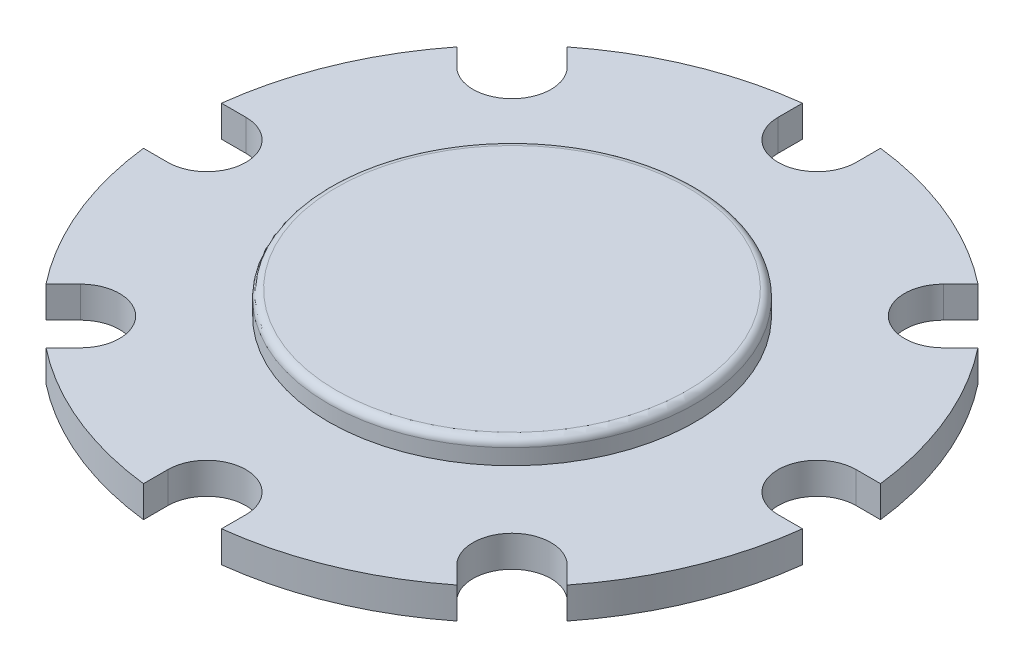
ISO-10303-21;
HEADER;
FILE_DESCRIPTION(('STEP AP214'),'2;1');
FILE_NAME('part.step','',(''),(''),'','','');
FILE_SCHEMA(('AUTOMOTIVE_DESIGN { 1 0 10303 214 1 1 1 1 }'));
ENDSEC;
DATA;
#1=APPLICATION_CONTEXT('core data for automotive mechanical design processes');
#2=APPLICATION_PROTOCOL_DEFINITION('international standard','automotive_design',2000,#1);
#3=PRODUCT_CONTEXT('',#1,'mechanical');
#4=PRODUCT('Part','Part','',(#3));
#5=PRODUCT_RELATED_PRODUCT_CATEGORY('part','',(#4));
#6=PRODUCT_DEFINITION_FORMATION('','',#4);
#7=PRODUCT_DEFINITION_CONTEXT('part definition',#1,'design');
#8=PRODUCT_DEFINITION('design','',#6,#7);
#9=PRODUCT_DEFINITION_SHAPE('','',#8);
#10=(LENGTH_UNIT() NAMED_UNIT(*) SI_UNIT(.MILLI.,.METRE.));
#11=(NAMED_UNIT(*) PLANE_ANGLE_UNIT() SI_UNIT($,.RADIAN.));
#12=(NAMED_UNIT(*) SI_UNIT($,.STERADIAN.) SOLID_ANGLE_UNIT());
#13=UNCERTAINTY_MEASURE_WITH_UNIT(LENGTH_MEASURE(1.E-05),#10,'distance_accuracy_value','');
#14=(GEOMETRIC_REPRESENTATION_CONTEXT(3) GLOBAL_UNCERTAINTY_ASSIGNED_CONTEXT((#13)) GLOBAL_UNIT_ASSIGNED_CONTEXT((#10,
#11,#12)) REPRESENTATION_CONTEXT('',''));
#15=CARTESIAN_POINT('',(0.,0.,0.));
#16=DIRECTION('',(0.,0.,1.));
#17=DIRECTION('',(1.,0.,0.));
#18=AXIS2_PLACEMENT_3D('',#15,#16,#17);
#19=CARTESIAN_POINT('',(0.,2.,0.));
#20=DIRECTION('',(0.,-1.,0.));
#21=DIRECTION('',(0.,0.,-1.));
#22=AXIS2_PLACEMENT_3D('',#19,#20,#21);
#23=CYLINDRICAL_SURFACE('',#22,21.25);
#24=CARTESIAN_POINT('',(0.,0.,0.));
#25=DIRECTION('',(0.,1.,0.));
#26=DIRECTION('',(0.,0.,1.));
#27=AXIS2_PLACEMENT_3D('',#24,#25,#26);
#28=CIRCLE('',#27,21.25);
#29=CARTESIAN_POINT('',(-16.689437435858,0.,-13.1539035299254));
#30=VERTEX_POINT('',#29);
#31=CARTESIAN_POINT('',(-21.1024287701677,0.,-2.50000000000007));
#32=VERTEX_POINT('',#31);
#33=EDGE_CURVE('E479',#30,#32,#28,.T.);
#34=ORIENTED_EDGE('',*,*,#33,.T.);
#35=DIRECTION('',(0.,-1.,0.));
#36=VECTOR('',#35,1.);
#37=CARTESIAN_POINT('',(-21.1024287701677,2.,-2.50000000000007));
#38=LINE('',#37,#36);
#39=CARTESIAN_POINT('',(-21.1024287701677,2.,-2.50000000000007));
#40=VERTEX_POINT('',#39);
#41=EDGE_CURVE('E254',#32,#40,#38,.F.);
#42=ORIENTED_EDGE('',*,*,#41,.T.);
#43=CARTESIAN_POINT('',(0.,2.,0.));
#44=DIRECTION('',(0.,1.,0.));
#45=DIRECTION('',(0.,0.,1.));
#46=AXIS2_PLACEMENT_3D('',#43,#44,#45);
#47=CIRCLE('',#46,21.25);
#48=CARTESIAN_POINT('',(-16.689437435858,2.,-13.1539035299254));
#49=VERTEX_POINT('',#48);
#50=EDGE_CURVE('E520',#49,#40,#47,.T.);
#51=ORIENTED_EDGE('',*,*,#50,.F.);
#52=DIRECTION('',(0.,-1.,0.));
#53=VECTOR('',#52,1.);
#54=CARTESIAN_POINT('',(-16.689437435858,2.,-13.1539035299254));
#55=LINE('',#54,#53);
#56=EDGE_CURVE('E358',#49,#30,#55,.T.);
#57=ORIENTED_EDGE('',*,*,#56,.T.);
#58=EDGE_LOOP('',(#34,#42,#51,#57));
#59=FACE_BOUND('',#58,.T.);
#60=ADVANCED_FACE('F33',(#59),#23,.T.);
#61=CARTESIAN_POINT('',(-2.5,0.,-21.1024287701677));
#62=VERTEX_POINT('',#61);
#63=CARTESIAN_POINT('',(-13.1539035299252,0.,-16.6894374358581));
#64=VERTEX_POINT('',#63);
#65=EDGE_CURVE('E470',#62,#64,#28,.T.);
#66=ORIENTED_EDGE('',*,*,#65,.T.);
#67=DIRECTION('',(0.,-1.,0.));
#68=VECTOR('',#67,1.);
#69=CARTESIAN_POINT('',(-13.1539035299252,2.,-16.6894374358581));
#70=LINE('',#69,#68);
#71=CARTESIAN_POINT('',(-13.1539035299252,2.,-16.6894374358581));
#72=VERTEX_POINT('',#71);
#73=EDGE_CURVE('E363',#64,#72,#70,.F.);
#74=ORIENTED_EDGE('',*,*,#73,.T.);
#75=CARTESIAN_POINT('',(-2.5,2.,-21.1024287701677));
#76=VERTEX_POINT('',#75);
#77=EDGE_CURVE('E517',#76,#72,#47,.T.);
#78=ORIENTED_EDGE('',*,*,#77,.F.);
#79=DIRECTION('',(0.,-1.,0.));
#80=VECTOR('',#79,1.);
#81=CARTESIAN_POINT('',(-2.5,2.,-21.1024287701677));
#82=LINE('',#81,#80);
#83=EDGE_CURVE('E346',#76,#62,#82,.T.);
#84=ORIENTED_EDGE('',*,*,#83,.T.);
#85=EDGE_LOOP('',(#66,#74,#78,#84));
#86=FACE_BOUND('',#85,.T.);
#87=ADVANCED_FACE('F475',(#86),#23,.T.);
#88=CARTESIAN_POINT('',(13.1539035299254,0.,-16.6894374358579));
#89=VERTEX_POINT('',#88);
#90=CARTESIAN_POINT('',(2.5,0.,-21.1024287701677));
#91=VERTEX_POINT('',#90);
#92=EDGE_CURVE('E478',#89,#91,#28,.T.);
#93=ORIENTED_EDGE('',*,*,#92,.T.);
#94=DIRECTION('',(0.,-1.,0.));
#95=VECTOR('',#94,1.);
#96=CARTESIAN_POINT('',(2.5,2.,-21.1024287701677));
#97=LINE('',#96,#95);
#98=CARTESIAN_POINT('',(2.5,2.,-21.1024287701677));
#99=VERTEX_POINT('',#98);
#100=EDGE_CURVE('E351',#91,#99,#97,.F.);
#101=ORIENTED_EDGE('',*,*,#100,.T.);
#102=CARTESIAN_POINT('',(13.1539035299254,2.,-16.6894374358579));
#103=VERTEX_POINT('',#102);
#104=EDGE_CURVE('E514',#103,#99,#47,.T.);
#105=ORIENTED_EDGE('',*,*,#104,.F.);
#106=DIRECTION('',(0.,-1.,0.));
#107=VECTOR('',#106,1.);
#108=CARTESIAN_POINT('',(13.1539035299254,2.,-16.6894374358579));
#109=LINE('',#108,#107);
#110=EDGE_CURVE('E334',#103,#89,#109,.T.);
#111=ORIENTED_EDGE('',*,*,#110,.T.);
#112=EDGE_LOOP('',(#93,#101,#105,#111));
#113=FACE_BOUND('',#112,.T.);
#114=ADVANCED_FACE('F552',(#113),#23,.T.);
#115=CARTESIAN_POINT('',(21.1024287701677,0.,-2.49999999999978));
#116=VERTEX_POINT('',#115);
#117=CARTESIAN_POINT('',(16.6894374358581,0.,-13.1539035299251));
#118=VERTEX_POINT('',#117);
#119=EDGE_CURVE('E481',#116,#118,#28,.T.);
#120=ORIENTED_EDGE('',*,*,#119,.T.);
#121=DIRECTION('',(0.,-1.,0.));
#122=VECTOR('',#121,1.);
#123=CARTESIAN_POINT('',(16.6894374358581,2.,-13.1539035299251));
#124=LINE('',#123,#122);
#125=CARTESIAN_POINT('',(16.6894374358581,2.,-13.1539035299251));
#126=VERTEX_POINT('',#125);
#127=EDGE_CURVE('E339',#118,#126,#124,.F.);
#128=ORIENTED_EDGE('',*,*,#127,.T.);
#129=CARTESIAN_POINT('',(21.1024287701677,2.,-2.49999999999978));
#130=VERTEX_POINT('',#129);
#131=EDGE_CURVE('E512',#130,#126,#47,.T.);
#132=ORIENTED_EDGE('',*,*,#131,.F.);
#133=DIRECTION('',(0.,-1.,0.));
#134=VECTOR('',#133,1.);
#135=CARTESIAN_POINT('',(21.1024287701677,2.,-2.49999999999978));
#136=LINE('',#135,#134);
#137=EDGE_CURVE('E322',#130,#116,#136,.T.);
#138=ORIENTED_EDGE('',*,*,#137,.T.);
#139=EDGE_LOOP('',(#120,#128,#132,#138));
#140=FACE_BOUND('',#139,.T.);
#141=ADVANCED_FACE('F494',(#140),#23,.T.);
#142=CARTESIAN_POINT('',(16.6894374358579,0.,13.1539035299255));
#143=VERTEX_POINT('',#142);
#144=CARTESIAN_POINT('',(21.1024287701676,0.,2.50000000000022));
#145=VERTEX_POINT('',#144);
#146=EDGE_CURVE('E441',#143,#145,#28,.T.);
#147=ORIENTED_EDGE('',*,*,#146,.T.);
#148=DIRECTION('',(0.,-1.,0.));
#149=VECTOR('',#148,1.);
#150=CARTESIAN_POINT('',(21.1024287701676,2.,2.50000000000022));
#151=LINE('',#150,#149);
#152=CARTESIAN_POINT('',(21.1024287701676,2.,2.50000000000022));
#153=VERTEX_POINT('',#152);
#154=EDGE_CURVE('E327',#145,#153,#151,.F.);
#155=ORIENTED_EDGE('',*,*,#154,.T.);
#156=CARTESIAN_POINT('',(16.6894374358579,2.,13.1539035299255));
#157=VERTEX_POINT('',#156);
#158=EDGE_CURVE('E435',#157,#153,#47,.T.);
#159=ORIENTED_EDGE('',*,*,#158,.F.);
#160=DIRECTION('',(0.,-1.,0.));
#161=VECTOR('',#160,1.);
#162=CARTESIAN_POINT('',(16.6894374358579,2.,13.1539035299255));
#163=LINE('',#162,#161);
#164=EDGE_CURVE('E310',#157,#143,#163,.T.);
#165=ORIENTED_EDGE('',*,*,#164,.T.);
#166=EDGE_LOOP('',(#147,#155,#159,#165));
#167=FACE_BOUND('',#166,.T.);
#168=ADVANCED_FACE('F560',(#167),#23,.T.);
#169=CARTESIAN_POINT('',(2.5,0.,21.1024287701677));
#170=VERTEX_POINT('',#169);
#171=CARTESIAN_POINT('',(13.1539035299251,0.,16.6894374358582));
#172=VERTEX_POINT('',#171);
#173=EDGE_CURVE('E438',#170,#172,#28,.T.);
#174=ORIENTED_EDGE('',*,*,#173,.T.);
#175=DIRECTION('',(0.,-1.,0.));
#176=VECTOR('',#175,1.);
#177=CARTESIAN_POINT('',(13.1539035299251,2.,16.6894374358582));
#178=LINE('',#177,#176);
#179=CARTESIAN_POINT('',(13.1539035299251,2.,16.6894374358582));
#180=VERTEX_POINT('',#179);
#181=EDGE_CURVE('E315',#172,#180,#178,.F.);
#182=ORIENTED_EDGE('',*,*,#181,.T.);
#183=CARTESIAN_POINT('',(2.5,2.,21.1024287701677));
#184=VERTEX_POINT('',#183);
#185=EDGE_CURVE('E431',#184,#180,#47,.T.);
#186=ORIENTED_EDGE('',*,*,#185,.F.);
#187=DIRECTION('',(0.,-1.,0.));
#188=VECTOR('',#187,1.);
#189=CARTESIAN_POINT('',(2.5,2.,21.1024287701677));
#190=LINE('',#189,#188);
#191=EDGE_CURVE('E416',#184,#170,#190,.T.);
#192=ORIENTED_EDGE('',*,*,#191,.T.);
#193=EDGE_LOOP('',(#174,#182,#186,#192));
#194=FACE_BOUND('',#193,.T.);
#195=ADVANCED_FACE('F546',(#194),#23,.T.);
#196=CARTESIAN_POINT('',(-21.1024287701677,2.,2.49999999999993));
#197=VERTEX_POINT('',#196);
#198=CARTESIAN_POINT('',(-16.689437435858,2.,13.1539035299253));
#199=VERTEX_POINT('',#198);
#200=EDGE_CURVE('E436',#197,#199,#47,.T.);
#201=ORIENTED_EDGE('',*,*,#200,.F.);
#202=DIRECTION('',(0.,-1.,0.));
#203=VECTOR('',#202,1.);
#204=CARTESIAN_POINT('',(-21.1024287701677,2.,2.49999999999993));
#205=LINE('',#204,#203);
#206=CARTESIAN_POINT('',(-21.1024287701677,0.,2.49999999999993));
#207=VERTEX_POINT('',#206);
#208=EDGE_CURVE('E370',#197,#207,#205,.T.);
#209=ORIENTED_EDGE('',*,*,#208,.T.);
#210=CARTESIAN_POINT('',(-16.689437435858,0.,13.1539035299253));
#211=VERTEX_POINT('',#210);
#212=EDGE_CURVE('E442',#207,#211,#28,.T.);
#213=ORIENTED_EDGE('',*,*,#212,.T.);
#214=DIRECTION('',(0.,-1.,0.));
#215=VECTOR('',#214,1.);
#216=CARTESIAN_POINT('',(-16.689437435858,2.,13.1539035299253));
#217=LINE('',#216,#215);
#218=EDGE_CURVE('E394',#211,#199,#217,.F.);
#219=ORIENTED_EDGE('',*,*,#218,.T.);
#220=EDGE_LOOP('',(#201,#209,#213,#219));
#221=FACE_BOUND('',#220,.T.);
#222=ADVANCED_FACE('F540',(#221),#23,.T.);
#223=CARTESIAN_POINT('',(-13.1539035299253,2.,16.689437435858));
#224=VERTEX_POINT('',#223);
#225=CARTESIAN_POINT('',(-2.5,2.,21.1024287701677));
#226=VERTEX_POINT('',#225);
#227=EDGE_CURVE('E437',#224,#226,#47,.T.);
#228=ORIENTED_EDGE('',*,*,#227,.F.);
#229=DIRECTION('',(0.,-1.,0.));
#230=VECTOR('',#229,1.);
#231=CARTESIAN_POINT('',(-13.1539035299253,2.,16.689437435858));
#232=LINE('',#231,#230);
#233=CARTESIAN_POINT('',(-13.1539035299253,0.,16.689437435858));
#234=VERTEX_POINT('',#233);
#235=EDGE_CURVE('E388',#224,#234,#232,.T.);
#236=ORIENTED_EDGE('',*,*,#235,.T.);
#237=CARTESIAN_POINT('',(-2.5,0.,21.1024287701677));
#238=VERTEX_POINT('',#237);
#239=EDGE_CURVE('E430',#234,#238,#28,.T.);
#240=ORIENTED_EDGE('',*,*,#239,.T.);
#241=DIRECTION('',(0.,-1.,0.));
#242=VECTOR('',#241,1.);
#243=CARTESIAN_POINT('',(-2.5,2.,21.1024287701677));
#244=LINE('',#243,#242);
#245=EDGE_CURVE('E422',#238,#226,#244,.F.);
#246=ORIENTED_EDGE('',*,*,#245,.T.);
#247=EDGE_LOOP('',(#228,#236,#240,#246));
#248=FACE_BOUND('',#247,.T.);
#249=ADVANCED_FACE('F538',(#248),#23,.T.);
#250=CARTESIAN_POINT('',(0.,2.,0.));
#251=DIRECTION('',(0.,1.,0.));
#252=DIRECTION('',(0.,0.,1.));
#253=AXIS2_PLACEMENT_3D('',#250,#251,#252);
#254=PLANE('',#253);
#255=DIRECTION('',(-1.,0.,0.));
#256=VECTOR('',#255,1.);
#257=CARTESIAN_POINT('',(0.,2.,-2.5));
#258=LINE('',#257,#256);
#259=CARTESIAN_POINT('',(-19.54,2.,-2.50000000000007));
#260=VERTEX_POINT('',#259);
#261=EDGE_CURVE('E373',#260,#40,#258,.T.);
#262=ORIENTED_EDGE('',*,*,#261,.F.);
#263=CARTESIAN_POINT('',(-19.54,2.,0.));
#264=DIRECTION('',(0.,1.,0.));
#265=DIRECTION('',(0.,0.,1.));
#266=AXIS2_PLACEMENT_3D('',#263,#264,#265);
#267=CIRCLE('',#266,2.5);
#268=CARTESIAN_POINT('',(-19.54,2.,2.49999999999993));
#269=VERTEX_POINT('',#268);
#270=EDGE_CURVE('E246',#269,#260,#267,.T.);
#271=ORIENTED_EDGE('',*,*,#270,.F.);
#272=DIRECTION('',(1.,0.,0.));
#273=VECTOR('',#272,1.);
#274=CARTESIAN_POINT('',(0.,2.,2.5));
#275=LINE('',#274,#273);
#276=EDGE_CURVE('E368',#197,#269,#275,.T.);
#277=ORIENTED_EDGE('',*,*,#276,.F.);
#278=ORIENTED_EDGE('',*,*,#200,.T.);
#279=DIRECTION('',(-0.707106781186549,0.,0.707106781186546));
#280=VECTOR('',#279,1.);
#281=CARTESIAN_POINT('',(-1.76776695296637,2.,-1.76776695296637));
#282=LINE('',#281,#280);
#283=CARTESIAN_POINT('',(-15.5846334573515,2.,12.0490995514187));
#284=VERTEX_POINT('',#283);
#285=EDGE_CURVE('E391',#284,#199,#282,.T.);
#286=ORIENTED_EDGE('',*,*,#285,.F.);
#287=CARTESIAN_POINT('',(-13.8168665043852,2.,13.8168665043851));
#288=DIRECTION('',(0.,1.,0.));
#289=DIRECTION('',(0.,0.,1.));
#290=AXIS2_PLACEMENT_3D('',#287,#288,#289);
#291=CIRCLE('',#290,2.5);
#292=CARTESIAN_POINT('',(-12.0490995514188,2.,15.5846334573515));
#293=VERTEX_POINT('',#292);
#294=EDGE_CURVE('E397',#293,#284,#291,.T.);
#295=ORIENTED_EDGE('',*,*,#294,.F.);
#296=DIRECTION('',(0.707106781186549,0.,-0.707106781186546));
#297=VECTOR('',#296,1.);
#298=CARTESIAN_POINT('',(1.76776695296637,2.,1.76776695296637));
#299=LINE('',#298,#297);
#300=EDGE_CURVE('E384',#224,#293,#299,.T.);
#301=ORIENTED_EDGE('',*,*,#300,.F.);
#302=ORIENTED_EDGE('',*,*,#227,.T.);
#303=DIRECTION('',(0.,0.,1.));
#304=VECTOR('',#303,1.);
#305=CARTESIAN_POINT('',(-2.5,2.,0.));
#306=LINE('',#305,#304);
#307=CARTESIAN_POINT('',(-2.5,2.,19.54));
#308=VERTEX_POINT('',#307);
#309=EDGE_CURVE('E419',#308,#226,#306,.T.);
#310=ORIENTED_EDGE('',*,*,#309,.F.);
#311=CARTESIAN_POINT('',(0.,2.,19.54));
#312=DIRECTION('',(0.,1.,0.));
#313=DIRECTION('',(0.,0.,1.));
#314=AXIS2_PLACEMENT_3D('',#311,#312,#313);
#315=CIRCLE('',#314,2.5);
#316=CARTESIAN_POINT('',(2.5,2.,19.54));
#317=VERTEX_POINT('',#316);
#318=EDGE_CURVE('E425',#317,#308,#315,.T.);
#319=ORIENTED_EDGE('',*,*,#318,.F.);
#320=DIRECTION('',(0.,0.,-1.));
#321=VECTOR('',#320,1.);
#322=CARTESIAN_POINT('',(2.5,2.,0.));
#323=LINE('',#322,#321);
#324=EDGE_CURVE('E412',#184,#317,#323,.T.);
#325=ORIENTED_EDGE('',*,*,#324,.F.);
#326=ORIENTED_EDGE('',*,*,#185,.T.);
#327=DIRECTION('',(0.707106781186539,0.,0.707106781186556));
#328=VECTOR('',#327,1.);
#329=CARTESIAN_POINT('',(-1.76776695296639,2.,1.76776695296635));
#330=LINE('',#329,#328);
#331=CARTESIAN_POINT('',(12.0490995514186,2.,15.5846334573517));
#332=VERTEX_POINT('',#331);
#333=EDGE_CURVE('E313',#332,#180,#330,.T.);
#334=ORIENTED_EDGE('',*,*,#333,.F.);
#335=CARTESIAN_POINT('',(13.816866504385,2.,13.8168665043853));
#336=DIRECTION('',(0.,1.,0.));
#337=DIRECTION('',(0.,0.,1.));
#338=AXIS2_PLACEMENT_3D('',#335,#336,#337);
#339=CIRCLE('',#338,2.5);
#340=CARTESIAN_POINT('',(15.5846334573514,2.,12.049099551419));
#341=VERTEX_POINT('',#340);
#342=EDGE_CURVE('E318',#341,#332,#339,.T.);
#343=ORIENTED_EDGE('',*,*,#342,.F.);
#344=DIRECTION('',(-0.707106781186539,0.,-0.707106781186556));
#345=VECTOR('',#344,1.);
#346=CARTESIAN_POINT('',(1.76776695296639,2.,-1.76776695296635));
#347=LINE('',#346,#345);
#348=EDGE_CURVE('E249',#157,#341,#347,.T.);
#349=ORIENTED_EDGE('',*,*,#348,.F.);
#350=ORIENTED_EDGE('',*,*,#158,.T.);
#351=DIRECTION('',(1.,0.,0.));
#352=VECTOR('',#351,1.);
#353=CARTESIAN_POINT('',(0.,2.,2.5));
#354=LINE('',#353,#352);
#355=CARTESIAN_POINT('',(19.54,2.,2.5000000000002));
#356=VERTEX_POINT('',#355);
#357=EDGE_CURVE('E325',#356,#153,#354,.T.);
#358=ORIENTED_EDGE('',*,*,#357,.F.);
#359=CARTESIAN_POINT('',(19.54,2.,2.04670636082985E-13));
#360=DIRECTION('',(0.,1.,0.));
#361=DIRECTION('',(0.,0.,1.));
#362=AXIS2_PLACEMENT_3D('',#359,#360,#361);
#363=CIRCLE('',#362,2.5);
#364=CARTESIAN_POINT('',(19.54,2.,-2.4999999999998));
#365=VERTEX_POINT('',#364);
#366=EDGE_CURVE('E330',#365,#356,#363,.T.);
#367=ORIENTED_EDGE('',*,*,#366,.F.);
#368=DIRECTION('',(-1.,0.,0.));
#369=VECTOR('',#368,1.);
#370=CARTESIAN_POINT('',(0.,2.,-2.5));
#371=LINE('',#370,#369);
#372=EDGE_CURVE('E320',#130,#365,#371,.T.);
#373=ORIENTED_EDGE('',*,*,#372,.F.);
#374=ORIENTED_EDGE('',*,*,#131,.T.);
#375=DIRECTION('',(0.707106781186554,0.,-0.707106781186541));
#376=VECTOR('',#375,1.);
#377=CARTESIAN_POINT('',(1.76776695296635,2.,1.76776695296638));
#378=LINE('',#377,#376);
#379=CARTESIAN_POINT('',(15.5846334573516,2.,-12.0490995514186));
#380=VERTEX_POINT('',#379);
#381=EDGE_CURVE('E337',#380,#126,#378,.T.);
#382=ORIENTED_EDGE('',*,*,#381,.F.);
#383=CARTESIAN_POINT('',(13.8168665043853,2.,-13.816866504385));
#384=DIRECTION('',(0.,1.,0.));
#385=DIRECTION('',(0.,0.,1.));
#386=AXIS2_PLACEMENT_3D('',#383,#384,#385);
#387=CIRCLE('',#386,2.5);
#388=CARTESIAN_POINT('',(12.0490995514189,2.,-15.5846334573514));
#389=VERTEX_POINT('',#388);
#390=EDGE_CURVE('E342',#389,#380,#387,.T.);
#391=ORIENTED_EDGE('',*,*,#390,.F.);
#392=DIRECTION('',(-0.707106781186554,0.,0.707106781186541));
#393=VECTOR('',#392,1.);
#394=CARTESIAN_POINT('',(-1.76776695296635,2.,-1.76776695296638));
#395=LINE('',#394,#393);
#396=EDGE_CURVE('E332',#103,#389,#395,.T.);
#397=ORIENTED_EDGE('',*,*,#396,.F.);
#398=ORIENTED_EDGE('',*,*,#104,.T.);
#399=DIRECTION('',(0.,0.,-1.));
#400=VECTOR('',#399,1.);
#401=CARTESIAN_POINT('',(2.5,2.,0.));
#402=LINE('',#401,#400);
#403=CARTESIAN_POINT('',(2.5,2.,-19.54));
#404=VERTEX_POINT('',#403);
#405=EDGE_CURVE('E349',#404,#99,#402,.T.);
#406=ORIENTED_EDGE('',*,*,#405,.F.);
#407=CARTESIAN_POINT('',(0.,2.,-19.54));
#408=DIRECTION('',(0.,1.,0.));
#409=DIRECTION('',(0.,0.,1.));
#410=AXIS2_PLACEMENT_3D('',#407,#408,#409);
#411=CIRCLE('',#410,2.5);
#412=CARTESIAN_POINT('',(-2.5,2.,-19.54));
#413=VERTEX_POINT('',#412);
#414=EDGE_CURVE('E354',#413,#404,#411,.T.);
#415=ORIENTED_EDGE('',*,*,#414,.F.);
#416=DIRECTION('',(0.,0.,1.));
#417=VECTOR('',#416,1.);
#418=CARTESIAN_POINT('',(-2.5,2.,0.));
#419=LINE('',#418,#417);
#420=EDGE_CURVE('E344',#76,#413,#419,.T.);
#421=ORIENTED_EDGE('',*,*,#420,.F.);
#422=ORIENTED_EDGE('',*,*,#77,.T.);
#423=DIRECTION('',(-0.707106781186544,0.,-0.707106781186551));
#424=VECTOR('',#423,1.);
#425=CARTESIAN_POINT('',(1.76776695296638,2.,-1.76776695296636));
#426=LINE('',#425,#424);
#427=CARTESIAN_POINT('',(-12.0490995514187,2.,-15.5846334573516));
#428=VERTEX_POINT('',#427);
#429=EDGE_CURVE('E361',#428,#72,#426,.T.);
#430=ORIENTED_EDGE('',*,*,#429,.F.);
#431=CARTESIAN_POINT('',(-13.8168665043851,2.,-13.8168665043852));
#432=DIRECTION('',(0.,1.,0.));
#433=DIRECTION('',(0.,0.,1.));
#434=AXIS2_PLACEMENT_3D('',#431,#432,#433);
#435=CIRCLE('',#434,2.5);
#436=CARTESIAN_POINT('',(-15.5846334573515,2.,-12.0490995514189));
#437=VERTEX_POINT('',#436);
#438=EDGE_CURVE('E366',#437,#428,#435,.T.);
#439=ORIENTED_EDGE('',*,*,#438,.F.);
#440=DIRECTION('',(0.707106781186544,0.,0.707106781186551));
#441=VECTOR('',#440,1.);
#442=CARTESIAN_POINT('',(-1.76776695296638,2.,1.76776695296636));
#443=LINE('',#442,#441);
#444=EDGE_CURVE('E356',#49,#437,#443,.T.);
#445=ORIENTED_EDGE('',*,*,#444,.F.);
#446=ORIENTED_EDGE('',*,*,#50,.T.);
#447=EDGE_LOOP('',(#262,#271,#277,#278,#286,#295,#301,#302,#310,#319,#325,#326,#334,#343,#349,
#350,#358,#367,#373,#374,#382,#391,#397,#398,#406,#415,#421,#422,#430,#439,#445,#446));
#448=FACE_BOUND('',#447,.T.);
#449=CARTESIAN_POINT('',(0.,2.,0.));
#450=DIRECTION('',(0.,1.,0.));
#451=DIRECTION('',(0.,0.,1.));
#452=AXIS2_PLACEMENT_3D('',#449,#450,#451);
#453=CIRCLE('',#452,11.75);
#454=CARTESIAN_POINT('',(0.,2.,11.75));
#455=VERTEX_POINT('',#454);
#456=EDGE_CURVE('E427',#455,#455,#453,.T.);
#457=ORIENTED_EDGE('',*,*,#456,.F.);
#458=EDGE_LOOP('',(#457));
#459=FACE_BOUND('',#458,.T.);
#460=ADVANCED_FACE('F508',(#448,#459),#254,.T.);
#461=CARTESIAN_POINT('',(0.,0.,0.));
#462=DIRECTION('',(0.,1.,0.));
#463=DIRECTION('',(0.,0.,1.));
#464=AXIS2_PLACEMENT_3D('',#461,#462,#463);
#465=PLANE('',#464);
#466=CARTESIAN_POINT('',(0.,0.,0.));
#467=DIRECTION('',(0.,-1.,0.));
#468=DIRECTION('',(0.,0.,-1.));
#469=AXIS2_PLACEMENT_3D('',#466,#467,#468);
#470=CIRCLE('',#469,1.65438293583384);
#471=CARTESIAN_POINT('',(0.,0.,-1.65438293583384));
#472=VERTEX_POINT('',#471);
#473=EDGE_CURVE('E399',#472,#472,#470,.T.);
#474=ORIENTED_EDGE('',*,*,#473,.F.);
#475=EDGE_LOOP('',(#474));
#476=FACE_BOUND('',#475,.T.);
#477=CARTESIAN_POINT('',(-19.54,0.,0.));
#478=DIRECTION('',(0.,-1.,0.));
#479=DIRECTION('',(1.,0.,0.));
#480=AXIS2_PLACEMENT_3D('',#477,#478,#479);
#481=CIRCLE('',#480,2.5);
#482=CARTESIAN_POINT('',(-19.54,0.,-2.50000000000007));
#483=VERTEX_POINT('',#482);
#484=CARTESIAN_POINT('',(-19.54,0.,2.49999999999993));
#485=VERTEX_POINT('',#484);
#486=EDGE_CURVE('E48',#483,#485,#481,.T.);
#487=ORIENTED_EDGE('',*,*,#486,.F.);
#488=DIRECTION('',(-1.,0.,0.));
#489=VECTOR('',#488,1.);
#490=CARTESIAN_POINT('',(0.,0.,-2.5));
#491=LINE('',#490,#489);
#492=EDGE_CURVE('E11',#483,#32,#491,.T.);
#493=ORIENTED_EDGE('',*,*,#492,.T.);
#494=ORIENTED_EDGE('',*,*,#33,.F.);
#495=DIRECTION('',(-0.707106781186544,0.,-0.707106781186551));
#496=VECTOR('',#495,1.);
#497=CARTESIAN_POINT('',(-15.5846334573515,0.,-12.0490995514189));
#498=LINE('',#497,#496);
#499=CARTESIAN_POINT('',(-15.5846334573515,0.,-12.0490995514189));
#500=VERTEX_POINT('',#499);
#501=EDGE_CURVE('E270',#500,#30,#498,.T.);
#502=ORIENTED_EDGE('',*,*,#501,.F.);
#503=CARTESIAN_POINT('',(-13.8168665043851,0.,-13.8168665043852));
#504=DIRECTION('',(0.,-1.,0.));
#505=DIRECTION('',(0.707106781186544,0.,0.707106781186551));
#506=AXIS2_PLACEMENT_3D('',#503,#504,#505);
#507=CIRCLE('',#506,2.5);
#508=CARTESIAN_POINT('',(-12.0490995514187,0.,-15.5846334573516));
#509=VERTEX_POINT('',#508);
#510=EDGE_CURVE('E56',#509,#500,#507,.T.);
#511=ORIENTED_EDGE('',*,*,#510,.F.);
#512=DIRECTION('',(-0.707106781186544,0.,-0.707106781186551));
#513=VECTOR('',#512,1.);
#514=CARTESIAN_POINT('',(1.76776695296638,0.,-1.76776695296636));
#515=LINE('',#514,#513);
#516=EDGE_CURVE('E41',#509,#64,#515,.T.);
#517=ORIENTED_EDGE('',*,*,#516,.T.);
#518=ORIENTED_EDGE('',*,*,#65,.F.);
#519=DIRECTION('',(0.,0.,-1.));
#520=VECTOR('',#519,1.);
#521=CARTESIAN_POINT('',(-2.5,0.,-19.54));
#522=LINE('',#521,#520);
#523=CARTESIAN_POINT('',(-2.5,0.,-19.54));
#524=VERTEX_POINT('',#523);
#525=EDGE_CURVE('E276',#524,#62,#522,.T.);
#526=ORIENTED_EDGE('',*,*,#525,.F.);
#527=CARTESIAN_POINT('',(0.,0.,-19.54));
#528=DIRECTION('',(0.,-1.,0.));
#529=DIRECTION('',(0.,0.,1.));
#530=AXIS2_PLACEMENT_3D('',#527,#528,#529);
#531=CIRCLE('',#530,2.5);
#532=CARTESIAN_POINT('',(2.5,0.,-19.54));
#533=VERTEX_POINT('',#532);
#534=EDGE_CURVE('E274',#533,#524,#531,.T.);
#535=ORIENTED_EDGE('',*,*,#534,.F.);
#536=DIRECTION('',(0.,0.,-1.));
#537=VECTOR('',#536,1.);
#538=CARTESIAN_POINT('',(2.5,0.,0.));
#539=LINE('',#538,#537);
#540=EDGE_CURVE('E463',#533,#91,#539,.T.);
#541=ORIENTED_EDGE('',*,*,#540,.T.);
#542=ORIENTED_EDGE('',*,*,#92,.F.);
#543=DIRECTION('',(0.707106781186554,0.,-0.707106781186541));
#544=VECTOR('',#543,1.);
#545=CARTESIAN_POINT('',(12.0490995514189,0.,-15.5846334573514));
#546=LINE('',#545,#544);
#547=CARTESIAN_POINT('',(12.0490995514189,0.,-15.5846334573514));
#548=VERTEX_POINT('',#547);
#549=EDGE_CURVE('E285',#548,#89,#546,.T.);
#550=ORIENTED_EDGE('',*,*,#549,.F.);
#551=CARTESIAN_POINT('',(13.8168665043853,0.,-13.816866504385));
#552=DIRECTION('',(0.,-1.,0.));
#553=DIRECTION('',(-0.707106781186554,0.,0.707106781186541));
#554=AXIS2_PLACEMENT_3D('',#551,#552,#553);
#555=CIRCLE('',#554,2.5);
#556=CARTESIAN_POINT('',(15.5846334573516,0.,-12.0490995514186));
#557=VERTEX_POINT('',#556);
#558=EDGE_CURVE('E283',#557,#548,#555,.T.);
#559=ORIENTED_EDGE('',*,*,#558,.F.);
#560=DIRECTION('',(0.707106781186554,0.,-0.707106781186541));
#561=VECTOR('',#560,1.);
#562=CARTESIAN_POINT('',(1.76776695296635,0.,1.76776695296638));
#563=LINE('',#562,#561);
#564=EDGE_CURVE('E460',#557,#118,#563,.T.);
#565=ORIENTED_EDGE('',*,*,#564,.T.);
#566=ORIENTED_EDGE('',*,*,#119,.F.);
#567=DIRECTION('',(1.,0.,0.));
#568=VECTOR('',#567,1.);
#569=CARTESIAN_POINT('',(19.54,0.,-2.4999999999998));
#570=LINE('',#569,#568);
#571=CARTESIAN_POINT('',(19.54,0.,-2.4999999999998));
#572=VERTEX_POINT('',#571);
#573=EDGE_CURVE('E294',#572,#116,#570,.T.);
#574=ORIENTED_EDGE('',*,*,#573,.F.);
#575=CARTESIAN_POINT('',(19.54,0.,2.04670636082985E-13));
#576=DIRECTION('',(0.,-1.,0.));
#577=DIRECTION('',(-1.,0.,0.));
#578=AXIS2_PLACEMENT_3D('',#575,#576,#577);
#579=CIRCLE('',#578,2.5);
#580=CARTESIAN_POINT('',(19.54,0.,2.5000000000002));
#581=VERTEX_POINT('',#580);
#582=EDGE_CURVE('E292',#581,#572,#579,.T.);
#583=ORIENTED_EDGE('',*,*,#582,.F.);
#584=DIRECTION('',(1.,0.,0.));
#585=VECTOR('',#584,1.);
#586=CARTESIAN_POINT('',(0.,0.,2.5));
#587=LINE('',#586,#585);
#588=EDGE_CURVE('E457',#581,#145,#587,.T.);
#589=ORIENTED_EDGE('',*,*,#588,.T.);
#590=ORIENTED_EDGE('',*,*,#146,.F.);
#591=DIRECTION('',(0.707106781186539,0.,0.707106781186556));
#592=VECTOR('',#591,1.);
#593=CARTESIAN_POINT('',(15.5846334573514,0.,12.049099551419));
#594=LINE('',#593,#592);
#595=CARTESIAN_POINT('',(15.5846334573514,0.,12.049099551419));
#596=VERTEX_POINT('',#595);
#597=EDGE_CURVE('E303',#596,#143,#594,.T.);
#598=ORIENTED_EDGE('',*,*,#597,.F.);
#599=CARTESIAN_POINT('',(13.816866504385,0.,13.8168665043853));
#600=DIRECTION('',(0.,-1.,0.));
#601=DIRECTION('',(-0.707106781186539,0.,-0.707106781186556));
#602=AXIS2_PLACEMENT_3D('',#599,#600,#601);
#603=CIRCLE('',#602,2.5);
#604=CARTESIAN_POINT('',(12.0490995514186,0.,15.5846334573517));
#605=VERTEX_POINT('',#604);
#606=EDGE_CURVE('E301',#605,#596,#603,.T.);
#607=ORIENTED_EDGE('',*,*,#606,.F.);
#608=DIRECTION('',(0.707106781186539,0.,0.707106781186556));
#609=VECTOR('',#608,1.);
#610=CARTESIAN_POINT('',(-1.76776695296639,0.,1.76776695296635));
#611=LINE('',#610,#609);
#612=EDGE_CURVE('E454',#605,#172,#611,.T.);
#613=ORIENTED_EDGE('',*,*,#612,.T.);
#614=ORIENTED_EDGE('',*,*,#173,.F.);
#615=DIRECTION('',(0.,0.,1.));
#616=VECTOR('',#615,1.);
#617=CARTESIAN_POINT('',(2.5,0.,19.54));
#618=LINE('',#617,#616);
#619=CARTESIAN_POINT('',(2.5,0.,19.54));
#620=VERTEX_POINT('',#619);
#621=EDGE_CURVE('E407',#620,#170,#618,.T.);
#622=ORIENTED_EDGE('',*,*,#621,.F.);
#623=CARTESIAN_POINT('',(0.,0.,19.54));
#624=DIRECTION('',(0.,-1.,0.));
#625=DIRECTION('',(0.,0.,-1.));
#626=AXIS2_PLACEMENT_3D('',#623,#624,#625);
#627=CIRCLE('',#626,2.5);
#628=CARTESIAN_POINT('',(-2.5,0.,19.54));
#629=VERTEX_POINT('',#628);
#630=EDGE_CURVE('E403',#629,#620,#627,.T.);
#631=ORIENTED_EDGE('',*,*,#630,.F.);
#632=DIRECTION('',(0.,0.,1.));
#633=VECTOR('',#632,1.);
#634=CARTESIAN_POINT('',(-2.5,0.,0.));
#635=LINE('',#634,#633);
#636=EDGE_CURVE('E448',#629,#238,#635,.T.);
#637=ORIENTED_EDGE('',*,*,#636,.T.);
#638=ORIENTED_EDGE('',*,*,#239,.F.);
#639=DIRECTION('',(-0.707106781186549,0.,0.707106781186546));
#640=VECTOR('',#639,1.);
#641=CARTESIAN_POINT('',(-12.0490995514188,0.,15.5846334573515));
#642=LINE('',#641,#640);
#643=CARTESIAN_POINT('',(-12.0490995514188,0.,15.5846334573515));
#644=VERTEX_POINT('',#643);
#645=EDGE_CURVE('E379',#644,#234,#642,.T.);
#646=ORIENTED_EDGE('',*,*,#645,.F.);
#647=CARTESIAN_POINT('',(-13.8168665043852,0.,13.8168665043851));
#648=DIRECTION('',(0.,-1.,0.));
#649=DIRECTION('',(0.707106781186549,0.,-0.707106781186546));
#650=AXIS2_PLACEMENT_3D('',#647,#648,#649);
#651=CIRCLE('',#650,2.5);
#652=CARTESIAN_POINT('',(-15.5846334573515,0.,12.0490995514187));
#653=VERTEX_POINT('',#652);
#654=EDGE_CURVE('E377',#653,#644,#651,.T.);
#655=ORIENTED_EDGE('',*,*,#654,.F.);
#656=DIRECTION('',(-0.707106781186549,0.,0.707106781186546));
#657=VECTOR('',#656,1.);
#658=CARTESIAN_POINT('',(-1.76776695296637,0.,-1.76776695296637));
#659=LINE('',#658,#657);
#660=EDGE_CURVE('E451',#653,#211,#659,.T.);
#661=ORIENTED_EDGE('',*,*,#660,.T.);
#662=ORIENTED_EDGE('',*,*,#212,.F.);
#663=DIRECTION('',(-1.,0.,0.));
#664=VECTOR('',#663,1.);
#665=CARTESIAN_POINT('',(-19.54,0.,2.49999999999993));
#666=LINE('',#665,#664);
#667=EDGE_CURVE('E261',#485,#207,#666,.T.);
#668=ORIENTED_EDGE('',*,*,#667,.F.);
#669=EDGE_LOOP('',(#487,#493,#494,#502,#511,#517,#518,#526,#535,#541,#542,#550,#559,#565,#566,
#574,#583,#589,#590,#598,#607,#613,#614,#622,#631,#637,#638,#646,#655,#661,#662,#668));
#670=FACE_BOUND('',#669,.T.);
#671=ADVANCED_FACE('F259',(#476,#670),#465,.F.);
#672=CARTESIAN_POINT('',(0.,3.5,0.));
#673=DIRECTION('',(0.,-1.,0.));
#674=DIRECTION('',(0.,0.,-1.));
#675=AXIS2_PLACEMENT_3D('',#672,#673,#674);
#676=CYLINDRICAL_SURFACE('',#675,11.75);
#677=CARTESIAN_POINT('',(0.,3.,0.));
#678=DIRECTION('',(0.,1.,0.));
#679=DIRECTION('',(0.,0.,1.));
#680=AXIS2_PLACEMENT_3D('',#677,#678,#679);
#681=CIRCLE('',#680,11.75);
#682=CARTESIAN_POINT('',(0.,3.,11.75));
#683=VERTEX_POINT('',#682);
#684=EDGE_CURVE('E445',#683,#683,#681,.F.);
#685=ORIENTED_EDGE('',*,*,#684,.T.);
#686=EDGE_LOOP('',(#685));
#687=FACE_BOUND('',#686,.T.);
#688=ORIENTED_EDGE('',*,*,#456,.T.);
#689=EDGE_LOOP('',(#688));
#690=FACE_BOUND('',#689,.T.);
#691=ADVANCED_FACE('F651',(#687,#690),#676,.T.);
#692=CARTESIAN_POINT('',(0.,3.5,0.));
#693=DIRECTION('',(0.,1.,0.));
#694=DIRECTION('',(0.,0.,1.));
#695=AXIS2_PLACEMENT_3D('',#692,#693,#694);
#696=PLANE('',#695);
#697=CARTESIAN_POINT('',(0.,3.5,0.));
#698=DIRECTION('',(0.,1.,0.));
#699=DIRECTION('',(0.,0.,1.));
#700=AXIS2_PLACEMENT_3D('',#697,#698,#699);
#701=CIRCLE('',#700,11.25);
#702=CARTESIAN_POINT('',(0.,3.5,11.25));
#703=VERTEX_POINT('',#702);
#704=EDGE_CURVE('E434',#703,#703,#701,.T.);
#705=ORIENTED_EDGE('',*,*,#704,.T.);
#706=EDGE_LOOP('',(#705));
#707=FACE_BOUND('',#706,.T.);
#708=ADVANCED_FACE('F648',(#707),#696,.T.);
#709=CARTESIAN_POINT('',(0.,3.,0.));
#710=DIRECTION('',(0.,1.,0.));
#711=DIRECTION('',(0.,0.,1.));
#712=AXIS2_PLACEMENT_3D('',#709,#710,#711);
#713=TOROIDAL_SURFACE('',#712,11.25,0.5);
#714=ORIENTED_EDGE('',*,*,#684,.F.);
#715=EDGE_LOOP('',(#714));
#716=FACE_BOUND('',#715,.T.);
#717=ORIENTED_EDGE('',*,*,#704,.F.);
#718=EDGE_LOOP('',(#717));
#719=FACE_BOUND('',#718,.T.);
#720=ADVANCED_FACE('F35',(#716,#719),#713,.T.);
#721=CARTESIAN_POINT('',(-2.5,3.5,19.54));
#722=DIRECTION('',(-1.,0.,0.));
#723=DIRECTION('',(0.,0.,1.));
#724=AXIS2_PLACEMENT_3D('',#721,#722,#723);
#725=PLANE('',#724);
#726=ORIENTED_EDGE('',*,*,#636,.F.);
#727=DIRECTION('',(0.,-1.,0.));
#728=VECTOR('',#727,1.);
#729=CARTESIAN_POINT('',(-2.5,3.5,19.54));
#730=LINE('',#729,#728);
#731=EDGE_CURVE('E410',#308,#629,#730,.T.);
#732=ORIENTED_EDGE('',*,*,#731,.F.);
#733=ORIENTED_EDGE('',*,*,#309,.T.);
#734=ORIENTED_EDGE('',*,*,#245,.F.);
#735=EDGE_LOOP('',(#726,#732,#733,#734));
#736=FACE_BOUND('',#735,.T.);
#737=ADVANCED_FACE('F537',(#736),#725,.F.);
#738=CARTESIAN_POINT('',(2.5,3.5,19.54));
#739=DIRECTION('',(1.,0.,0.));
#740=DIRECTION('',(0.,0.,-1.));
#741=AXIS2_PLACEMENT_3D('',#738,#739,#740);
#742=PLANE('',#741);
#743=ORIENTED_EDGE('',*,*,#324,.T.);
#744=DIRECTION('',(0.,-1.,0.));
#745=VECTOR('',#744,1.);
#746=CARTESIAN_POINT('',(2.5,3.5,19.54));
#747=LINE('',#746,#745);
#748=EDGE_CURVE('E409',#317,#620,#747,.T.);
#749=ORIENTED_EDGE('',*,*,#748,.T.);
#750=ORIENTED_EDGE('',*,*,#621,.T.);
#751=ORIENTED_EDGE('',*,*,#191,.F.);
#752=EDGE_LOOP('',(#743,#749,#750,#751));
#753=FACE_BOUND('',#752,.T.);
#754=ADVANCED_FACE('F641',(#753),#742,.F.);
#755=CARTESIAN_POINT('',(0.,3.5,19.54));
#756=DIRECTION('',(0.,-1.,0.));
#757=DIRECTION('',(0.,0.,-1.));
#758=AXIS2_PLACEMENT_3D('',#755,#756,#757);
#759=CYLINDRICAL_SURFACE('',#758,2.5);
#760=ORIENTED_EDGE('',*,*,#318,.T.);
#761=ORIENTED_EDGE('',*,*,#731,.T.);
#762=ORIENTED_EDGE('',*,*,#630,.T.);
#763=ORIENTED_EDGE('',*,*,#748,.F.);
#764=EDGE_LOOP('',(#760,#761,#762,#763));
#765=FACE_BOUND('',#764,.T.);
#766=ADVANCED_FACE('F637',(#765),#759,.F.);
#767=CARTESIAN_POINT('',(0.,0.01,0.));
#768=DIRECTION('',(0.,-1.,0.));
#769=DIRECTION('',(0.,0.,-1.));
#770=AXIS2_PLACEMENT_3D('',#767,#768,#769);
#771=CYLINDRICAL_SURFACE('',#770,1.65438293583384);
#772=CARTESIAN_POINT('',(0.,0.01,0.));
#773=DIRECTION('',(0.,-1.,0.));
#774=DIRECTION('',(0.,0.,-1.));
#775=AXIS2_PLACEMENT_3D('',#772,#773,#774);
#776=CIRCLE('',#775,1.65438293583384);
#777=CARTESIAN_POINT('',(0.,0.01,-1.65438293583384));
#778=VERTEX_POINT('',#777);
#779=EDGE_CURVE('E400',#778,#778,#776,.T.);
#780=ORIENTED_EDGE('',*,*,#779,.F.);
#781=EDGE_LOOP('',(#780));
#782=FACE_BOUND('',#781,.T.);
#783=ORIENTED_EDGE('',*,*,#473,.T.);
#784=EDGE_LOOP('',(#783));
#785=FACE_BOUND('',#784,.T.);
#786=ADVANCED_FACE('F633',(#782,#785),#771,.F.);
#787=CARTESIAN_POINT('',(0.,0.01,0.));
#788=DIRECTION('',(0.,-1.,0.));
#789=DIRECTION('',(0.,0.,-1.));
#790=AXIS2_PLACEMENT_3D('',#787,#788,#789);
#791=PLANE('',#790);
#792=ORIENTED_EDGE('',*,*,#779,.T.);
#793=EDGE_LOOP('',(#792));
#794=FACE_BOUND('',#793,.T.);
#795=ADVANCED_FACE('F623',(#794),#791,.T.);
#796=CARTESIAN_POINT('',(-15.5846334573515,3.5,12.0490995514187));
#797=DIRECTION('',(-0.707106781186546,0.,-0.707106781186549));
#798=DIRECTION('',(-0.707106781186549,0.,0.707106781186546));
#799=AXIS2_PLACEMENT_3D('',#796,#797,#798);
#800=PLANE('',#799);
#801=ORIENTED_EDGE('',*,*,#660,.F.);
#802=DIRECTION('',(0.,-1.,0.));
#803=VECTOR('',#802,1.);
#804=CARTESIAN_POINT('',(-15.5846334573515,3.5,12.0490995514187));
#805=LINE('',#804,#803);
#806=EDGE_CURVE('E382',#284,#653,#805,.T.);
#807=ORIENTED_EDGE('',*,*,#806,.F.);
#808=ORIENTED_EDGE('',*,*,#285,.T.);
#809=ORIENTED_EDGE('',*,*,#218,.F.);
#810=EDGE_LOOP('',(#801,#807,#808,#809));
#811=FACE_BOUND('',#810,.T.);
#812=ADVANCED_FACE('F619',(#811),#800,.F.);
#813=CARTESIAN_POINT('',(-12.0490995514188,3.5,15.5846334573515));
#814=DIRECTION('',(0.707106781186546,0.,0.707106781186549));
#815=DIRECTION('',(0.707106781186549,0.,-0.707106781186546));
#816=AXIS2_PLACEMENT_3D('',#813,#814,#815);
#817=PLANE('',#816);
#818=ORIENTED_EDGE('',*,*,#300,.T.);
#819=DIRECTION('',(0.,-1.,0.));
#820=VECTOR('',#819,1.);
#821=CARTESIAN_POINT('',(-12.0490995514188,3.5,15.5846334573515));
#822=LINE('',#821,#820);
#823=EDGE_CURVE('E381',#293,#644,#822,.T.);
#824=ORIENTED_EDGE('',*,*,#823,.T.);
#825=ORIENTED_EDGE('',*,*,#645,.T.);
#826=ORIENTED_EDGE('',*,*,#235,.F.);
#827=EDGE_LOOP('',(#818,#824,#825,#826));
#828=FACE_BOUND('',#827,.T.);
#829=ADVANCED_FACE('F622',(#828),#817,.F.);
#830=CARTESIAN_POINT('',(-13.8168665043852,3.5,13.8168665043851));
#831=DIRECTION('',(0.,-1.,0.));
#832=DIRECTION('',(0.,0.,-1.));
#833=AXIS2_PLACEMENT_3D('',#830,#831,#832);
#834=CYLINDRICAL_SURFACE('',#833,2.5);
#835=ORIENTED_EDGE('',*,*,#294,.T.);
#836=ORIENTED_EDGE('',*,*,#806,.T.);
#837=ORIENTED_EDGE('',*,*,#654,.T.);
#838=ORIENTED_EDGE('',*,*,#823,.F.);
#839=EDGE_LOOP('',(#835,#836,#837,#838));
#840=FACE_BOUND('',#839,.T.);
#841=ADVANCED_FACE('F611',(#840),#834,.F.);
#842=CARTESIAN_POINT('',(12.0490995514186,3.5,15.5846334573517));
#843=DIRECTION('',(-0.707106781186556,0.,0.707106781186539));
#844=DIRECTION('',(0.707106781186539,0.,0.707106781186556));
#845=AXIS2_PLACEMENT_3D('',#842,#843,#844);
#846=PLANE('',#845);
#847=ORIENTED_EDGE('',*,*,#612,.F.);
#848=DIRECTION('',(0.,-1.,0.));
#849=VECTOR('',#848,1.);
#850=CARTESIAN_POINT('',(12.0490995514186,3.5,15.5846334573517));
#851=LINE('',#850,#849);
#852=EDGE_CURVE('E295',#332,#605,#851,.T.);
#853=ORIENTED_EDGE('',*,*,#852,.F.);
#854=ORIENTED_EDGE('',*,*,#333,.T.);
#855=ORIENTED_EDGE('',*,*,#181,.F.);
#856=EDGE_LOOP('',(#847,#853,#854,#855));
#857=FACE_BOUND('',#856,.T.);
#858=ADVANCED_FACE('F607',(#857),#846,.F.);
#859=CARTESIAN_POINT('',(15.5846334573514,3.5,12.049099551419));
#860=DIRECTION('',(0.707106781186556,0.,-0.707106781186539));
#861=DIRECTION('',(-0.707106781186539,0.,-0.707106781186556));
#862=AXIS2_PLACEMENT_3D('',#859,#860,#861);
#863=PLANE('',#862);
#864=ORIENTED_EDGE('',*,*,#348,.T.);
#865=DIRECTION('',(0.,-1.,0.));
#866=VECTOR('',#865,1.);
#867=CARTESIAN_POINT('',(15.5846334573514,3.5,12.049099551419));
#868=LINE('',#867,#866);
#869=EDGE_CURVE('E305',#341,#596,#868,.T.);
#870=ORIENTED_EDGE('',*,*,#869,.T.);
#871=ORIENTED_EDGE('',*,*,#597,.T.);
#872=ORIENTED_EDGE('',*,*,#164,.F.);
#873=EDGE_LOOP('',(#864,#870,#871,#872));
#874=FACE_BOUND('',#873,.T.);
#875=ADVANCED_FACE('F610',(#874),#863,.F.);
#876=CARTESIAN_POINT('',(13.816866504385,3.5,13.8168665043853));
#877=DIRECTION('',(0.,-1.,0.));
#878=DIRECTION('',(0.,0.,-1.));
#879=AXIS2_PLACEMENT_3D('',#876,#877,#878);
#880=CYLINDRICAL_SURFACE('',#879,2.5);
#881=ORIENTED_EDGE('',*,*,#342,.T.);
#882=ORIENTED_EDGE('',*,*,#852,.T.);
#883=ORIENTED_EDGE('',*,*,#606,.T.);
#884=ORIENTED_EDGE('',*,*,#869,.F.);
#885=EDGE_LOOP('',(#881,#882,#883,#884));
#886=FACE_BOUND('',#885,.T.);
#887=ADVANCED_FACE('F599',(#886),#880,.F.);
#888=CARTESIAN_POINT('',(19.54,3.5,2.5000000000002));
#889=DIRECTION('',(0.,0.,1.));
#890=DIRECTION('',(1.,0.,0.));
#891=AXIS2_PLACEMENT_3D('',#888,#889,#890);
#892=PLANE('',#891);
#893=ORIENTED_EDGE('',*,*,#588,.F.);
#894=DIRECTION('',(0.,-1.,0.));
#895=VECTOR('',#894,1.);
#896=CARTESIAN_POINT('',(19.54,3.5,2.5000000000002));
#897=LINE('',#896,#895);
#898=EDGE_CURVE('E286',#356,#581,#897,.T.);
#899=ORIENTED_EDGE('',*,*,#898,.F.);
#900=ORIENTED_EDGE('',*,*,#357,.T.);
#901=ORIENTED_EDGE('',*,*,#154,.F.);
#902=EDGE_LOOP('',(#893,#899,#900,#901));
#903=FACE_BOUND('',#902,.T.);
#904=ADVANCED_FACE('F595',(#903),#892,.F.);
#905=CARTESIAN_POINT('',(19.54,3.5,-2.4999999999998));
#906=DIRECTION('',(0.,0.,-1.));
#907=DIRECTION('',(-1.,0.,0.));
#908=AXIS2_PLACEMENT_3D('',#905,#906,#907);
#909=PLANE('',#908);
#910=ORIENTED_EDGE('',*,*,#372,.T.);
#911=DIRECTION('',(0.,-1.,0.));
#912=VECTOR('',#911,1.);
#913=CARTESIAN_POINT('',(19.54,3.5,-2.4999999999998));
#914=LINE('',#913,#912);
#915=EDGE_CURVE('E297',#365,#572,#914,.T.);
#916=ORIENTED_EDGE('',*,*,#915,.T.);
#917=ORIENTED_EDGE('',*,*,#573,.T.);
#918=ORIENTED_EDGE('',*,*,#137,.F.);
#919=EDGE_LOOP('',(#910,#916,#917,#918));
#920=FACE_BOUND('',#919,.T.);
#921=ADVANCED_FACE('F598',(#920),#909,.F.);
#922=CARTESIAN_POINT('',(19.54,3.5,2.04670636082985E-13));
#923=DIRECTION('',(0.,-1.,0.));
#924=DIRECTION('',(0.,0.,-1.));
#925=AXIS2_PLACEMENT_3D('',#922,#923,#924);
#926=CYLINDRICAL_SURFACE('',#925,2.5);
#927=ORIENTED_EDGE('',*,*,#366,.T.);
#928=ORIENTED_EDGE('',*,*,#898,.T.);
#929=ORIENTED_EDGE('',*,*,#582,.T.);
#930=ORIENTED_EDGE('',*,*,#915,.F.);
#931=EDGE_LOOP('',(#927,#928,#929,#930));
#932=FACE_BOUND('',#931,.T.);
#933=ADVANCED_FACE('F588',(#932),#926,.F.);
#934=CARTESIAN_POINT('',(15.5846334573516,3.5,-12.0490995514186));
#935=DIRECTION('',(0.707106781186541,0.,0.707106781186554));
#936=DIRECTION('',(0.707106781186554,0.,-0.707106781186541));
#937=AXIS2_PLACEMENT_3D('',#934,#935,#936);
#938=PLANE('',#937);
#939=ORIENTED_EDGE('',*,*,#564,.F.);
#940=DIRECTION('',(0.,-1.,0.));
#941=VECTOR('',#940,1.);
#942=CARTESIAN_POINT('',(15.5846334573516,3.5,-12.0490995514186));
#943=LINE('',#942,#941);
#944=EDGE_CURVE('E277',#380,#557,#943,.T.);
#945=ORIENTED_EDGE('',*,*,#944,.F.);
#946=ORIENTED_EDGE('',*,*,#381,.T.);
#947=ORIENTED_EDGE('',*,*,#127,.F.);
#948=EDGE_LOOP('',(#939,#945,#946,#947));
#949=FACE_BOUND('',#948,.T.);
#950=ADVANCED_FACE('F504',(#949),#938,.F.);
#951=CARTESIAN_POINT('',(12.0490995514189,3.5,-15.5846334573514));
#952=DIRECTION('',(-0.707106781186541,0.,-0.707106781186554));
#953=DIRECTION('',(-0.707106781186554,0.,0.707106781186541));
#954=AXIS2_PLACEMENT_3D('',#951,#952,#953);
#955=PLANE('',#954);
#956=ORIENTED_EDGE('',*,*,#396,.T.);
#957=DIRECTION('',(0.,-1.,0.));
#958=VECTOR('',#957,1.);
#959=CARTESIAN_POINT('',(12.0490995514189,3.5,-15.5846334573514));
#960=LINE('',#959,#958);
#961=EDGE_CURVE('E288',#389,#548,#960,.T.);
#962=ORIENTED_EDGE('',*,*,#961,.T.);
#963=ORIENTED_EDGE('',*,*,#549,.T.);
#964=ORIENTED_EDGE('',*,*,#110,.F.);
#965=EDGE_LOOP('',(#956,#962,#963,#964));
#966=FACE_BOUND('',#965,.T.);
#967=ADVANCED_FACE('F587',(#966),#955,.F.);
#968=CARTESIAN_POINT('',(13.8168665043853,3.5,-13.816866504385));
#969=DIRECTION('',(0.,-1.,0.));
#970=DIRECTION('',(0.,0.,-1.));
#971=AXIS2_PLACEMENT_3D('',#968,#969,#970);
#972=CYLINDRICAL_SURFACE('',#971,2.5);
#973=ORIENTED_EDGE('',*,*,#390,.T.);
#974=ORIENTED_EDGE('',*,*,#944,.T.);
#975=ORIENTED_EDGE('',*,*,#558,.T.);
#976=ORIENTED_EDGE('',*,*,#961,.F.);
#977=EDGE_LOOP('',(#973,#974,#975,#976));
#978=FACE_BOUND('',#977,.T.);
#979=ADVANCED_FACE('F581',(#978),#972,.F.);
#980=CARTESIAN_POINT('',(2.5,3.5,-19.54));
#981=DIRECTION('',(1.,0.,0.));
#982=DIRECTION('',(0.,0.,-1.));
#983=AXIS2_PLACEMENT_3D('',#980,#981,#982);
#984=PLANE('',#983);
#985=ORIENTED_EDGE('',*,*,#540,.F.);
#986=DIRECTION('',(0.,-1.,0.));
#987=VECTOR('',#986,1.);
#988=CARTESIAN_POINT('',(2.5,3.5,-19.54));
#989=LINE('',#988,#987);
#990=EDGE_CURVE('E271',#404,#533,#989,.T.);
#991=ORIENTED_EDGE('',*,*,#990,.F.);
#992=ORIENTED_EDGE('',*,*,#405,.T.);
#993=ORIENTED_EDGE('',*,*,#100,.F.);
#994=EDGE_LOOP('',(#985,#991,#992,#993));
#995=FACE_BOUND('',#994,.T.);
#996=ADVANCED_FACE('F566',(#995),#984,.F.);
#997=CARTESIAN_POINT('',(-2.5,3.5,-19.54));
#998=DIRECTION('',(-1.,0.,0.));
#999=DIRECTION('',(0.,0.,1.));
#1000=AXIS2_PLACEMENT_3D('',#997,#998,#999);
#1001=PLANE('',#1000);
#1002=ORIENTED_EDGE('',*,*,#420,.T.);
#1003=DIRECTION('',(0.,-1.,0.));
#1004=VECTOR('',#1003,1.);
#1005=CARTESIAN_POINT('',(-2.5,3.5,-19.54));
#1006=LINE('',#1005,#1004);
#1007=EDGE_CURVE('E279',#413,#524,#1006,.T.);
#1008=ORIENTED_EDGE('',*,*,#1007,.T.);
#1009=ORIENTED_EDGE('',*,*,#525,.T.);
#1010=ORIENTED_EDGE('',*,*,#83,.F.);
#1011=EDGE_LOOP('',(#1002,#1008,#1009,#1010));
#1012=FACE_BOUND('',#1011,.T.);
#1013=ADVANCED_FACE('F572',(#1012),#1001,.F.);
#1014=CARTESIAN_POINT('',(0.,3.5,-19.54));
#1015=DIRECTION('',(0.,-1.,0.));
#1016=DIRECTION('',(0.,0.,-1.));
#1017=AXIS2_PLACEMENT_3D('',#1014,#1015,#1016);
#1018=CYLINDRICAL_SURFACE('',#1017,2.5);
#1019=ORIENTED_EDGE('',*,*,#414,.T.);
#1020=ORIENTED_EDGE('',*,*,#990,.T.);
#1021=ORIENTED_EDGE('',*,*,#534,.T.);
#1022=ORIENTED_EDGE('',*,*,#1007,.F.);
#1023=EDGE_LOOP('',(#1019,#1020,#1021,#1022));
#1024=FACE_BOUND('',#1023,.T.);
#1025=ADVANCED_FACE('F570',(#1024),#1018,.F.);
#1026=CARTESIAN_POINT('',(-12.0490995514187,3.5,-15.5846334573516));
#1027=DIRECTION('',(0.707106781186551,0.,-0.707106781186544));
#1028=DIRECTION('',(-0.707106781186544,0.,-0.707106781186551));
#1029=AXIS2_PLACEMENT_3D('',#1026,#1027,#1028);
#1030=PLANE('',#1029);
#1031=ORIENTED_EDGE('',*,*,#516,.F.);
#1032=DIRECTION('',(0.,-1.,0.));
#1033=VECTOR('',#1032,1.);
#1034=CARTESIAN_POINT('',(-12.0490995514187,3.5,-15.5846334573516));
#1035=LINE('',#1034,#1033);
#1036=EDGE_CURVE('E262',#428,#509,#1035,.T.);
#1037=ORIENTED_EDGE('',*,*,#1036,.F.);
#1038=ORIENTED_EDGE('',*,*,#429,.T.);
#1039=ORIENTED_EDGE('',*,*,#73,.F.);
#1040=EDGE_LOOP('',(#1031,#1037,#1038,#1039));
#1041=FACE_BOUND('',#1040,.T.);
#1042=ADVANCED_FACE('F579',(#1041),#1030,.F.);
#1043=CARTESIAN_POINT('',(-15.5846334573515,3.5,-12.0490995514189));
#1044=DIRECTION('',(-0.707106781186551,0.,0.707106781186544));
#1045=DIRECTION('',(0.707106781186544,0.,0.707106781186551));
#1046=AXIS2_PLACEMENT_3D('',#1043,#1044,#1045);
#1047=PLANE('',#1046);
#1048=ORIENTED_EDGE('',*,*,#444,.T.);
#1049=DIRECTION('',(0.,-1.,0.));
#1050=VECTOR('',#1049,1.);
#1051=CARTESIAN_POINT('',(-15.5846334573515,3.5,-12.0490995514189));
#1052=LINE('',#1051,#1050);
#1053=EDGE_CURVE('E265',#437,#500,#1052,.T.);
#1054=ORIENTED_EDGE('',*,*,#1053,.T.);
#1055=ORIENTED_EDGE('',*,*,#501,.T.);
#1056=ORIENTED_EDGE('',*,*,#56,.F.);
#1057=EDGE_LOOP('',(#1048,#1054,#1055,#1056));
#1058=FACE_BOUND('',#1057,.T.);
#1059=ADVANCED_FACE('F768',(#1058),#1047,.F.);
#1060=CARTESIAN_POINT('',(-13.8168665043851,3.5,-13.8168665043852));
#1061=DIRECTION('',(0.,-1.,0.));
#1062=DIRECTION('',(0.,0.,-1.));
#1063=AXIS2_PLACEMENT_3D('',#1060,#1061,#1062);
#1064=CYLINDRICAL_SURFACE('',#1063,2.5);
#1065=ORIENTED_EDGE('',*,*,#438,.T.);
#1066=ORIENTED_EDGE('',*,*,#1036,.T.);
#1067=ORIENTED_EDGE('',*,*,#510,.T.);
#1068=ORIENTED_EDGE('',*,*,#1053,.F.);
#1069=EDGE_LOOP('',(#1065,#1066,#1067,#1068));
#1070=FACE_BOUND('',#1069,.T.);
#1071=ADVANCED_FACE('F777',(#1070),#1064,.F.);
#1072=CARTESIAN_POINT('',(-19.54,3.5,-2.50000000000007));
#1073=DIRECTION('',(0.,0.,-1.));
#1074=DIRECTION('',(-1.,0.,0.));
#1075=AXIS2_PLACEMENT_3D('',#1072,#1073,#1074);
#1076=PLANE('',#1075);
#1077=ORIENTED_EDGE('',*,*,#492,.F.);
#1078=DIRECTION('',(0.,-1.,0.));
#1079=VECTOR('',#1078,1.);
#1080=CARTESIAN_POINT('',(-19.54,3.5,-2.50000000000007));
#1081=LINE('',#1080,#1079);
#1082=EDGE_CURVE('E242',#260,#483,#1081,.T.);
#1083=ORIENTED_EDGE('',*,*,#1082,.F.);
#1084=ORIENTED_EDGE('',*,*,#261,.T.);
#1085=ORIENTED_EDGE('',*,*,#41,.F.);
#1086=EDGE_LOOP('',(#1077,#1083,#1084,#1085));
#1087=FACE_BOUND('',#1086,.T.);
#1088=ADVANCED_FACE('F252',(#1087),#1076,.F.);
#1089=CARTESIAN_POINT('',(-19.54,3.5,2.49999999999993));
#1090=DIRECTION('',(0.,0.,1.));
#1091=DIRECTION('',(1.,0.,0.));
#1092=AXIS2_PLACEMENT_3D('',#1089,#1090,#1091);
#1093=PLANE('',#1092);
#1094=ORIENTED_EDGE('',*,*,#276,.T.);
#1095=DIRECTION('',(0.,-1.,0.));
#1096=VECTOR('',#1095,1.);
#1097=CARTESIAN_POINT('',(-19.54,3.5,2.49999999999993));
#1098=LINE('',#1097,#1096);
#1099=EDGE_CURVE('E250',#269,#485,#1098,.T.);
#1100=ORIENTED_EDGE('',*,*,#1099,.T.);
#1101=ORIENTED_EDGE('',*,*,#667,.T.);
#1102=ORIENTED_EDGE('',*,*,#208,.F.);
#1103=EDGE_LOOP('',(#1094,#1100,#1101,#1102));
#1104=FACE_BOUND('',#1103,.T.);
#1105=ADVANCED_FACE('F794',(#1104),#1093,.F.);
#1106=CARTESIAN_POINT('',(-19.54,3.5,0.));
#1107=DIRECTION('',(0.,-1.,0.));
#1108=DIRECTION('',(0.,0.,-1.));
#1109=AXIS2_PLACEMENT_3D('',#1106,#1107,#1108);
#1110=CYLINDRICAL_SURFACE('',#1109,2.5);
#1111=ORIENTED_EDGE('',*,*,#270,.T.);
#1112=ORIENTED_EDGE('',*,*,#1082,.T.);
#1113=ORIENTED_EDGE('',*,*,#486,.T.);
#1114=ORIENTED_EDGE('',*,*,#1099,.F.);
#1115=EDGE_LOOP('',(#1111,#1112,#1113,#1114));
#1116=FACE_BOUND('',#1115,.T.);
#1117=ADVANCED_FACE('F244',(#1116),#1110,.F.);
#1118=CLOSED_SHELL('',(#60,#87,#114,#141,#168,#195,#222,#249,#460,#671,#691,#708,#720,#737,#754,
#766,#786,#795,#812,#829,#841,#858,#875,#887,#904,#921,#933,#950,#967,#979,#996,#1013,#1025,
#1042,#1059,#1071,#1088,#1105,#1117));
#1119=MANIFOLD_SOLID_BREP('B2',#1118);
#1120=ADVANCED_BREP_SHAPE_REPRESENTATION('',(#18,#1119),#14);
#1121=SHAPE_DEFINITION_REPRESENTATION(#9,#1120);
ENDSEC;
END-ISO-10303-21;
